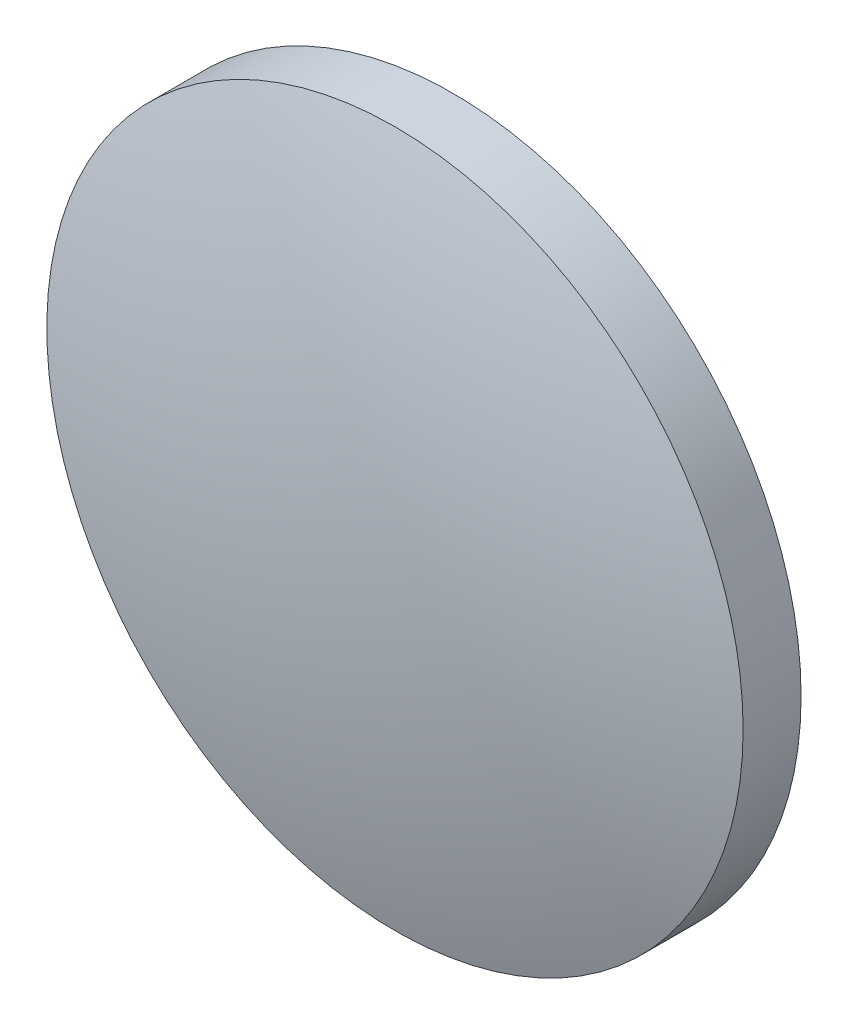
ISO-10303-21;
HEADER;
FILE_DESCRIPTION(('STEP AP214'),'2;1');
FILE_NAME('part.step','',(''),(''),'','','');
FILE_SCHEMA(('AUTOMOTIVE_DESIGN { 1 0 10303 214 1 1 1 1 }'));
ENDSEC;
DATA;
#1=APPLICATION_CONTEXT('core data for automotive mechanical design processes');
#2=APPLICATION_PROTOCOL_DEFINITION('international standard','automotive_design',2000,#1);
#3=PRODUCT_CONTEXT('',#1,'mechanical');
#4=PRODUCT('Part','Part','',(#3));
#5=PRODUCT_RELATED_PRODUCT_CATEGORY('part','',(#4));
#6=PRODUCT_DEFINITION_FORMATION('','',#4);
#7=PRODUCT_DEFINITION_CONTEXT('part definition',#1,'design');
#8=PRODUCT_DEFINITION('design','',#6,#7);
#9=PRODUCT_DEFINITION_SHAPE('','',#8);
#10=(LENGTH_UNIT() NAMED_UNIT(*) SI_UNIT(.MILLI.,.METRE.));
#11=(NAMED_UNIT(*) PLANE_ANGLE_UNIT() SI_UNIT($,.RADIAN.));
#12=(NAMED_UNIT(*) SI_UNIT($,.STERADIAN.) SOLID_ANGLE_UNIT());
#13=UNCERTAINTY_MEASURE_WITH_UNIT(LENGTH_MEASURE(1.E-05),#10,'distance_accuracy_value','');
#14=(GEOMETRIC_REPRESENTATION_CONTEXT(3) GLOBAL_UNCERTAINTY_ASSIGNED_CONTEXT((#13)) GLOBAL_UNIT_ASSIGNED_CONTEXT((#10,
#11,#12)) REPRESENTATION_CONTEXT('',''));
#15=CARTESIAN_POINT('',(0.,0.,0.));
#16=DIRECTION('',(0.,0.,1.));
#17=DIRECTION('',(1.,0.,0.));
#18=AXIS2_PLACEMENT_3D('',#15,#16,#17);
#19=CARTESIAN_POINT('',(0.,0.,-49.135));
#20=DIRECTION('',(0.,0.,1.));
#21=DIRECTION('',(0.,1.,0.));
#22=AXIS2_PLACEMENT_3D('',#19,#20,#21);
#23=SPHERICAL_SURFACE('',#22,51.5);
#24=CARTESIAN_POINT('',(0.,0.,0.132129000988073));
#25=DIRECTION('',(0.,0.,1.));
#26=DIRECTION('',(1.,0.,0.));
#27=AXIS2_PLACEMENT_3D('',#24,#25,#26);
#28=CIRCLE('',#27,15.);
#29=CARTESIAN_POINT('',(15.,0.,0.132129000988073));
#30=VERTEX_POINT('',#29);
#31=EDGE_CURVE('E8',#30,#30,#28,.T.);
#32=ORIENTED_EDGE('',*,*,#31,.T.);
#33=EDGE_LOOP('',(#32));
#34=FACE_BOUND('',#33,.T.);
#35=ADVANCED_FACE('F12',(#34),#23,.T.);
#36=CARTESIAN_POINT('',(0.,0.,4.30813204540037));
#37=DIRECTION('',(0.,0.,1.));
#38=DIRECTION('',(1.,0.,0.));
#39=AXIS2_PLACEMENT_3D('',#36,#37,#38);
#40=CYLINDRICAL_SURFACE('',#39,15.);
#41=ORIENTED_EDGE('',*,*,#31,.F.);
#42=EDGE_LOOP('',(#41));
#43=FACE_BOUND('',#42,.T.);
#44=CARTESIAN_POINT('',(0.,0.,-2.365));
#45=DIRECTION('',(0.,0.,1.));
#46=DIRECTION('',(1.,0.,0.));
#47=AXIS2_PLACEMENT_3D('',#44,#45,#46);
#48=CIRCLE('',#47,15.);
#49=CARTESIAN_POINT('',(15.,0.,-2.365));
#50=VERTEX_POINT('',#49);
#51=EDGE_CURVE('E18',#50,#50,#48,.T.);
#52=ORIENTED_EDGE('',*,*,#51,.T.);
#53=EDGE_LOOP('',(#52));
#54=FACE_BOUND('',#53,.T.);
#55=ADVANCED_FACE('F24',(#43,#54),#40,.T.);
#56=CARTESIAN_POINT('',(0.,0.,-2.365));
#57=DIRECTION('',(0.,0.,1.));
#58=DIRECTION('',(1.,0.,0.));
#59=AXIS2_PLACEMENT_3D('',#56,#57,#58);
#60=PLANE('',#59);
#61=ORIENTED_EDGE('',*,*,#51,.F.);
#62=EDGE_LOOP('',(#61));
#63=FACE_BOUND('',#62,.T.);
#64=ADVANCED_FACE('F26',(#63),#60,.F.);
#65=CLOSED_SHELL('',(#35,#55,#64));
#66=MANIFOLD_SOLID_BREP('B1',#65);
#67=ADVANCED_BREP_SHAPE_REPRESENTATION('',(#18,#66),#14);
#68=SHAPE_DEFINITION_REPRESENTATION(#9,#67);
ENDSEC;
END-ISO-10303-21;
